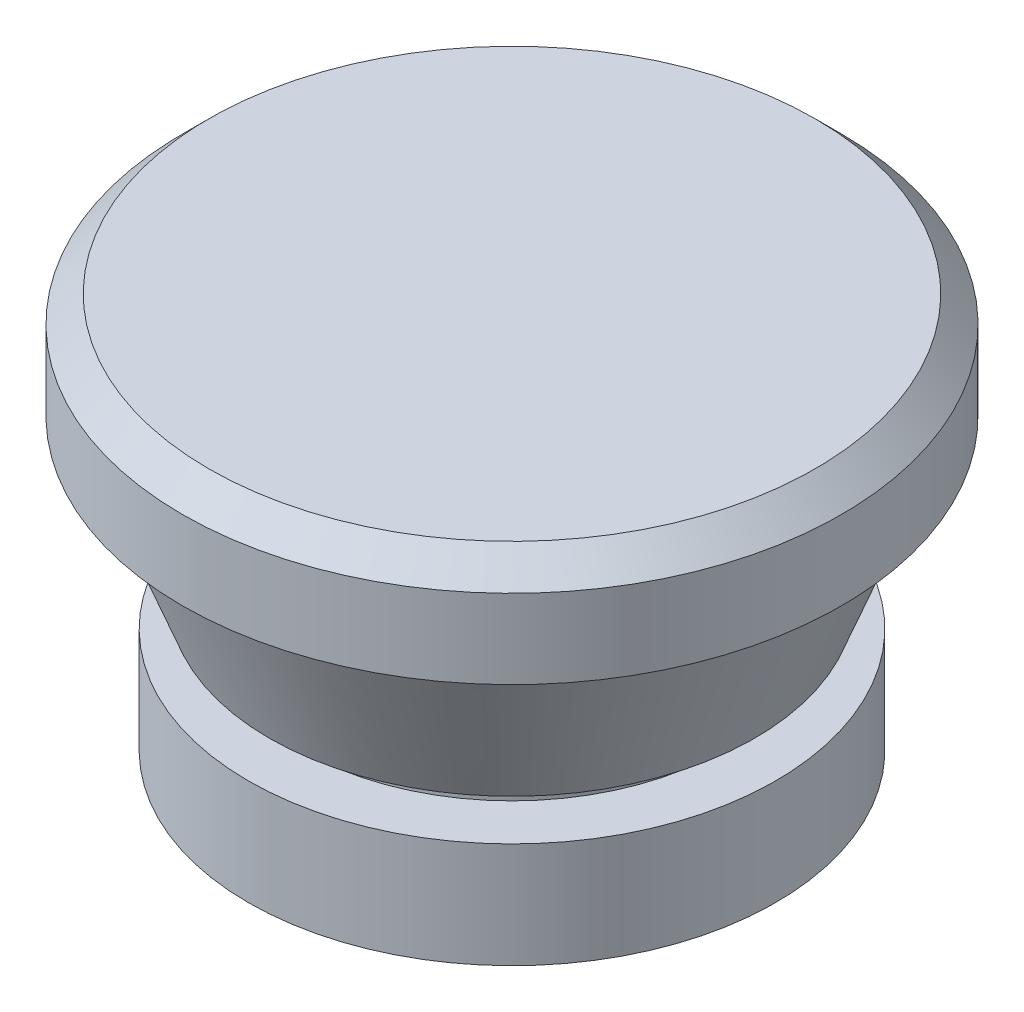
ISO-10303-21;
HEADER;
FILE_DESCRIPTION(('STEP AP214'),'2;1');
FILE_NAME('part.step','',(''),(''),'','','');
FILE_SCHEMA(('AUTOMOTIVE_DESIGN { 1 0 10303 214 1 1 1 1 }'));
ENDSEC;
DATA;
#1=APPLICATION_CONTEXT('core data for automotive mechanical design processes');
#2=APPLICATION_PROTOCOL_DEFINITION('international standard','automotive_design',2000,#1);
#3=PRODUCT_CONTEXT('',#1,'mechanical');
#4=PRODUCT('Part','Part','',(#3));
#5=PRODUCT_RELATED_PRODUCT_CATEGORY('part','',(#4));
#6=PRODUCT_DEFINITION_FORMATION('','',#4);
#7=PRODUCT_DEFINITION_CONTEXT('part definition',#1,'design');
#8=PRODUCT_DEFINITION('design','',#6,#7);
#9=PRODUCT_DEFINITION_SHAPE('','',#8);
#10=(LENGTH_UNIT() NAMED_UNIT(*) SI_UNIT(.MILLI.,.METRE.));
#11=(NAMED_UNIT(*) PLANE_ANGLE_UNIT() SI_UNIT($,.RADIAN.));
#12=(NAMED_UNIT(*) SI_UNIT($,.STERADIAN.) SOLID_ANGLE_UNIT());
#13=UNCERTAINTY_MEASURE_WITH_UNIT(LENGTH_MEASURE(1.E-05),#10,'distance_accuracy_value','');
#14=(GEOMETRIC_REPRESENTATION_CONTEXT(3) GLOBAL_UNCERTAINTY_ASSIGNED_CONTEXT((#13)) GLOBAL_UNIT_ASSIGNED_CONTEXT((#10,
#11,#12)) REPRESENTATION_CONTEXT('',''));
#15=CARTESIAN_POINT('',(0.,0.,0.));
#16=DIRECTION('',(0.,0.,1.));
#17=DIRECTION('',(1.,0.,0.));
#18=AXIS2_PLACEMENT_3D('',#15,#16,#17);
#19=CARTESIAN_POINT('',(0.,15.,0.));
#20=DIRECTION('',(0.,-1.,0.));
#21=DIRECTION('',(0.,0.,-1.));
#22=AXIS2_PLACEMENT_3D('',#19,#20,#21);
#23=PLANE('',#22);
#24=CARTESIAN_POINT('',(0.,15.,0.));
#25=DIRECTION('',(0.,1.,0.));
#26=DIRECTION('',(0.,0.,1.));
#27=AXIS2_PLACEMENT_3D('',#24,#25,#26);
#28=CIRCLE('',#27,11.5);
#29=CARTESIAN_POINT('',(0.,15.,11.5));
#30=VERTEX_POINT('',#29);
#31=EDGE_CURVE('E10',#30,#30,#28,.T.);
#32=ORIENTED_EDGE('',*,*,#31,.T.);
#33=EDGE_LOOP('',(#32));
#34=FACE_BOUND('',#33,.T.);
#35=ADVANCED_FACE('F31',(#34),#23,.F.);
#36=CARTESIAN_POINT('',(0.,14.,0.));
#37=DIRECTION('',(0.,-1.,0.));
#38=DIRECTION('',(0.,0.,-1.));
#39=AXIS2_PLACEMENT_3D('',#36,#37,#38);
#40=CONICAL_SURFACE('',#39,12.5,0.785398163397447);
#41=ORIENTED_EDGE('',*,*,#31,.F.);
#42=EDGE_LOOP('',(#41));
#43=FACE_BOUND('',#42,.T.);
#44=CARTESIAN_POINT('',(0.,14.,0.));
#45=DIRECTION('',(0.,1.,0.));
#46=DIRECTION('',(0.,0.,1.));
#47=AXIS2_PLACEMENT_3D('',#44,#45,#46);
#48=CIRCLE('',#47,12.5);
#49=CARTESIAN_POINT('',(0.,14.,12.5));
#50=VERTEX_POINT('',#49);
#51=EDGE_CURVE('E37',#50,#50,#48,.T.);
#52=ORIENTED_EDGE('',*,*,#51,.T.);
#53=EDGE_LOOP('',(#52));
#54=FACE_BOUND('',#53,.T.);
#55=ADVANCED_FACE('F99',(#43,#54),#40,.T.);
#56=CARTESIAN_POINT('',(0.,15.75,0.));
#57=DIRECTION('',(0.,1.,0.));
#58=DIRECTION('',(0.,0.,1.));
#59=AXIS2_PLACEMENT_3D('',#56,#57,#58);
#60=CYLINDRICAL_SURFACE('',#59,12.5);
#61=ORIENTED_EDGE('',*,*,#51,.F.);
#62=EDGE_LOOP('',(#61));
#63=FACE_BOUND('',#62,.T.);
#64=CARTESIAN_POINT('',(0.,11.,0.));
#65=DIRECTION('',(0.,1.,0.));
#66=DIRECTION('',(0.,0.,1.));
#67=AXIS2_PLACEMENT_3D('',#64,#65,#66);
#68=CIRCLE('',#67,12.5);
#69=CARTESIAN_POINT('',(0.,11.,12.5));
#70=VERTEX_POINT('',#69);
#71=EDGE_CURVE('E41',#70,#70,#68,.T.);
#72=ORIENTED_EDGE('',*,*,#71,.T.);
#73=EDGE_LOOP('',(#72));
#74=FACE_BOUND('',#73,.T.);
#75=ADVANCED_FACE('F103',(#63,#74),#60,.T.);
#76=CARTESIAN_POINT('',(12.5,11.,0.));
#77=DIRECTION('',(0.,1.,0.));
#78=DIRECTION('',(0.,0.,1.));
#79=AXIS2_PLACEMENT_3D('',#76,#77,#78);
#80=PLANE('',#79);
#81=ORIENTED_EDGE('',*,*,#71,.F.);
#82=EDGE_LOOP('',(#81));
#83=FACE_BOUND('',#82,.T.);
#84=CARTESIAN_POINT('',(0.,11.,0.));
#85=DIRECTION('',(0.,1.,0.));
#86=DIRECTION('',(0.,0.,1.));
#87=AXIS2_PLACEMENT_3D('',#84,#85,#86);
#88=CIRCLE('',#87,11.5);
#89=CARTESIAN_POINT('',(0.,11.,11.5));
#90=VERTEX_POINT('',#89);
#91=EDGE_CURVE('E45',#90,#90,#88,.T.);
#92=ORIENTED_EDGE('',*,*,#91,.T.);
#93=EDGE_LOOP('',(#92));
#94=FACE_BOUND('',#93,.T.);
#95=ADVANCED_FACE('F108',(#83,#94),#80,.F.);
#96=CARTESIAN_POINT('',(0.,5.,0.));
#97=DIRECTION('',(0.,1.,0.));
#98=DIRECTION('',(0.,0.,1.));
#99=AXIS2_PLACEMENT_3D('',#96,#97,#98);
#100=CONICAL_SURFACE('',#99,9.20267260579063,0.365668091977807);
#101=ORIENTED_EDGE('',*,*,#91,.F.);
#102=EDGE_LOOP('',(#101));
#103=FACE_BOUND('',#102,.T.);
#104=CARTESIAN_POINT('',(0.,5.,0.));
#105=DIRECTION('',(0.,1.,0.));
#106=DIRECTION('',(0.,0.,1.));
#107=AXIS2_PLACEMENT_3D('',#104,#105,#106);
#108=CIRCLE('',#107,9.20267260579063);
#109=CARTESIAN_POINT('',(0.,5.,9.20267260579063));
#110=VERTEX_POINT('',#109);
#111=EDGE_CURVE('E50',#110,#110,#108,.T.);
#112=ORIENTED_EDGE('',*,*,#111,.T.);
#113=EDGE_LOOP('',(#112));
#114=FACE_BOUND('',#113,.T.);
#115=ADVANCED_FACE('F114',(#103,#114),#100,.T.);
#116=CARTESIAN_POINT('',(9.20267260579063,5.,0.));
#117=DIRECTION('',(0.,1.,0.));
#118=DIRECTION('',(0.,0.,1.));
#119=AXIS2_PLACEMENT_3D('',#116,#117,#118);
#120=PLANE('',#119);
#121=ORIENTED_EDGE('',*,*,#111,.F.);
#122=EDGE_LOOP('',(#121));
#123=FACE_BOUND('',#122,.T.);
#124=CARTESIAN_POINT('',(0.,5.,0.));
#125=DIRECTION('',(0.,1.,0.));
#126=DIRECTION('',(0.,0.,1.));
#127=AXIS2_PLACEMENT_3D('',#124,#125,#126);
#128=CIRCLE('',#127,8.);
#129=CARTESIAN_POINT('',(0.,5.,8.));
#130=VERTEX_POINT('',#129);
#131=EDGE_CURVE('E53',#130,#130,#128,.T.);
#132=ORIENTED_EDGE('',*,*,#131,.T.);
#133=EDGE_LOOP('',(#132));
#134=FACE_BOUND('',#133,.T.);
#135=ADVANCED_FACE('F118',(#123,#134),#120,.F.);
#136=CARTESIAN_POINT('',(0.,15.75,0.));
#137=DIRECTION('',(0.,1.,0.));
#138=DIRECTION('',(0.,0.,1.));
#139=AXIS2_PLACEMENT_3D('',#136,#137,#138);
#140=CYLINDRICAL_SURFACE('',#139,8.);
#141=ORIENTED_EDGE('',*,*,#131,.F.);
#142=EDGE_LOOP('',(#141));
#143=FACE_BOUND('',#142,.T.);
#144=CARTESIAN_POINT('',(0.,4.,0.));
#145=DIRECTION('',(0.,1.,0.));
#146=DIRECTION('',(0.,0.,1.));
#147=AXIS2_PLACEMENT_3D('',#144,#145,#146);
#148=CIRCLE('',#147,8.);
#149=CARTESIAN_POINT('',(0.,4.,8.));
#150=VERTEX_POINT('',#149);
#151=EDGE_CURVE('E56',#150,#150,#148,.T.);
#152=ORIENTED_EDGE('',*,*,#151,.T.);
#153=EDGE_LOOP('',(#152));
#154=FACE_BOUND('',#153,.T.);
#155=ADVANCED_FACE('F94',(#143,#154),#140,.T.);
#156=CARTESIAN_POINT('',(8.,4.,0.));
#157=DIRECTION('',(0.,-1.,0.));
#158=DIRECTION('',(0.,0.,-1.));
#159=AXIS2_PLACEMENT_3D('',#156,#157,#158);
#160=PLANE('',#159);
#161=ORIENTED_EDGE('',*,*,#151,.F.);
#162=EDGE_LOOP('',(#161));
#163=FACE_BOUND('',#162,.T.);
#164=CARTESIAN_POINT('',(0.,4.,0.));
#165=DIRECTION('',(0.,1.,0.));
#166=DIRECTION('',(0.,0.,1.));
#167=AXIS2_PLACEMENT_3D('',#164,#165,#166);
#168=CIRCLE('',#167,10.);
#169=CARTESIAN_POINT('',(0.,4.,10.));
#170=VERTEX_POINT('',#169);
#171=EDGE_CURVE('E59',#170,#170,#168,.T.);
#172=ORIENTED_EDGE('',*,*,#171,.T.);
#173=EDGE_LOOP('',(#172));
#174=FACE_BOUND('',#173,.T.);
#175=ADVANCED_FACE('F88',(#163,#174),#160,.F.);
#176=CARTESIAN_POINT('',(0.,15.75,0.));
#177=DIRECTION('',(0.,1.,0.));
#178=DIRECTION('',(0.,0.,1.));
#179=AXIS2_PLACEMENT_3D('',#176,#177,#178);
#180=CYLINDRICAL_SURFACE('',#179,10.);
#181=ORIENTED_EDGE('',*,*,#171,.F.);
#182=EDGE_LOOP('',(#181));
#183=FACE_BOUND('',#182,.T.);
#184=CARTESIAN_POINT('',(0.,0.,0.));
#185=DIRECTION('',(0.,1.,0.));
#186=DIRECTION('',(0.,0.,1.));
#187=AXIS2_PLACEMENT_3D('',#184,#185,#186);
#188=CIRCLE('',#187,10.);
#189=CARTESIAN_POINT('',(0.,0.,10.));
#190=VERTEX_POINT('',#189);
#191=EDGE_CURVE('E62',#190,#190,#188,.T.);
#192=ORIENTED_EDGE('',*,*,#191,.T.);
#193=EDGE_LOOP('',(#192));
#194=FACE_BOUND('',#193,.T.);
#195=ADVANCED_FACE('F83',(#183,#194),#180,.T.);
#196=CARTESIAN_POINT('',(10.,0.,0.));
#197=DIRECTION('',(0.,1.,0.));
#198=DIRECTION('',(0.,0.,1.));
#199=AXIS2_PLACEMENT_3D('',#196,#197,#198);
#200=PLANE('',#199);
#201=CARTESIAN_POINT('',(0.,0.,0.));
#202=DIRECTION('',(0.,-1.,0.));
#203=DIRECTION('',(0.,0.,-1.));
#204=AXIS2_PLACEMENT_3D('',#201,#202,#203);
#205=CIRCLE('',#204,5.5);
#206=CARTESIAN_POINT('',(0.,0.,-5.5));
#207=VERTEX_POINT('',#206);
#208=EDGE_CURVE('E66',#207,#207,#205,.T.);
#209=ORIENTED_EDGE('',*,*,#208,.F.);
#210=EDGE_LOOP('',(#209));
#211=FACE_BOUND('',#210,.T.);
#212=ORIENTED_EDGE('',*,*,#191,.F.);
#213=EDGE_LOOP('',(#212));
#214=FACE_BOUND('',#213,.T.);
#215=ADVANCED_FACE('F77',(#211,#214),#200,.F.);
#216=CARTESIAN_POINT('',(0.,3.,0.));
#217=DIRECTION('',(0.,-1.,0.));
#218=DIRECTION('',(0.,0.,-1.));
#219=AXIS2_PLACEMENT_3D('',#216,#217,#218);
#220=CYLINDRICAL_SURFACE('',#219,5.5);
#221=CARTESIAN_POINT('',(0.,3.,0.));
#222=DIRECTION('',(0.,-1.,0.));
#223=DIRECTION('',(0.,0.,-1.));
#224=AXIS2_PLACEMENT_3D('',#221,#222,#223);
#225=CIRCLE('',#224,5.5);
#226=CARTESIAN_POINT('',(0.,3.,-5.5));
#227=VERTEX_POINT('',#226);
#228=EDGE_CURVE('E65',#227,#227,#225,.T.);
#229=ORIENTED_EDGE('',*,*,#228,.F.);
#230=EDGE_LOOP('',(#229));
#231=FACE_BOUND('',#230,.T.);
#232=ORIENTED_EDGE('',*,*,#208,.T.);
#233=EDGE_LOOP('',(#232));
#234=FACE_BOUND('',#233,.T.);
#235=ADVANCED_FACE('F74',(#231,#234),#220,.F.);
#236=CARTESIAN_POINT('',(0.,3.,0.));
#237=DIRECTION('',(0.,-1.,0.));
#238=DIRECTION('',(0.,0.,-1.));
#239=AXIS2_PLACEMENT_3D('',#236,#237,#238);
#240=PLANE('',#239);
#241=ORIENTED_EDGE('',*,*,#228,.T.);
#242=EDGE_LOOP('',(#241));
#243=FACE_BOUND('',#242,.T.);
#244=ADVANCED_FACE('F72',(#243),#240,.T.);
#245=CLOSED_SHELL('',(#35,#55,#75,#95,#115,#135,#155,#175,#195,#215,#235,#244));
#246=MANIFOLD_SOLID_BREP('B2',#245);
#247=ADVANCED_BREP_SHAPE_REPRESENTATION('',(#18,#246),#14);
#248=SHAPE_DEFINITION_REPRESENTATION(#9,#247);
ENDSEC;
END-ISO-10303-21;
